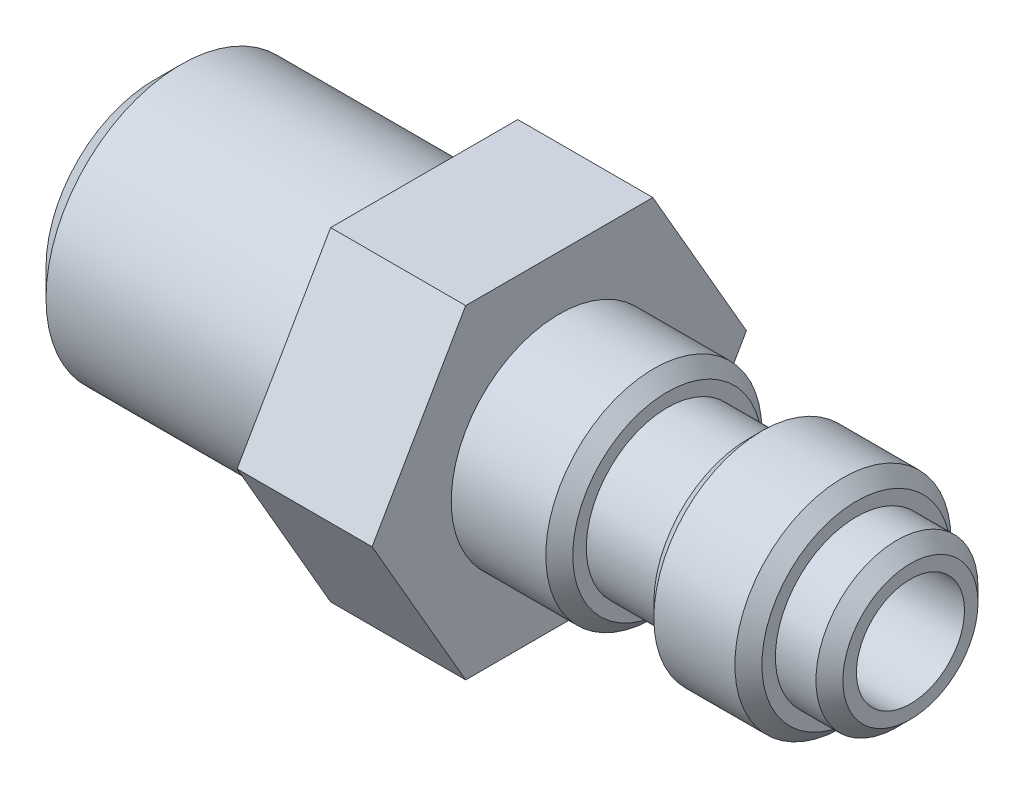
ISO-10303-21;
HEADER;
FILE_DESCRIPTION(('STEP AP214'),'2;1');
FILE_NAME('part.step','',(''),(''),'','','');
FILE_SCHEMA(('AUTOMOTIVE_DESIGN { 1 0 10303 214 1 1 1 1 }'));
ENDSEC;
DATA;
#1=APPLICATION_CONTEXT('core data for automotive mechanical design processes');
#2=APPLICATION_PROTOCOL_DEFINITION('international standard','automotive_design',2000,#1);
#3=PRODUCT_CONTEXT('',#1,'mechanical');
#4=PRODUCT('Part','Part','',(#3));
#5=PRODUCT_RELATED_PRODUCT_CATEGORY('part','',(#4));
#6=PRODUCT_DEFINITION_FORMATION('','',#4);
#7=PRODUCT_DEFINITION_CONTEXT('part definition',#1,'design');
#8=PRODUCT_DEFINITION('design','',#6,#7);
#9=PRODUCT_DEFINITION_SHAPE('','',#8);
#10=(LENGTH_UNIT() NAMED_UNIT(*) SI_UNIT(.MILLI.,.METRE.));
#11=(NAMED_UNIT(*) PLANE_ANGLE_UNIT() SI_UNIT($,.RADIAN.));
#12=(NAMED_UNIT(*) SI_UNIT($,.STERADIAN.) SOLID_ANGLE_UNIT());
#13=UNCERTAINTY_MEASURE_WITH_UNIT(LENGTH_MEASURE(1.E-05),#10,'distance_accuracy_value','');
#14=(GEOMETRIC_REPRESENTATION_CONTEXT(3) GLOBAL_UNCERTAINTY_ASSIGNED_CONTEXT((#13)) GLOBAL_UNIT_ASSIGNED_CONTEXT((#10,
#11,#12)) REPRESENTATION_CONTEXT('',''));
#15=CARTESIAN_POINT('',(0.,0.,0.));
#16=DIRECTION('',(0.,0.,1.));
#17=DIRECTION('',(1.,0.,0.));
#18=AXIS2_PLACEMENT_3D('',#15,#16,#17);
#19=CARTESIAN_POINT('',(0.,0.,0.));
#20=DIRECTION('',(1.,0.,0.));
#21=DIRECTION('',(0.,0.,-1.));
#22=AXIS2_PLACEMENT_3D('',#19,#20,#21);
#23=PLANE('',#22);
#24=CARTESIAN_POINT('',(0.,0.,0.));
#25=DIRECTION('',(1.,0.,0.));
#26=DIRECTION('',(0.,0.,-1.));
#27=AXIS2_PLACEMENT_3D('',#24,#25,#26);
#28=CIRCLE('',#27,2.49999999999999);
#29=CARTESIAN_POINT('',(0.,0.,-2.49999999999999));
#30=VERTEX_POINT('',#29);
#31=EDGE_CURVE('E163',#30,#30,#28,.T.);
#32=ORIENTED_EDGE('',*,*,#31,.T.);
#33=EDGE_LOOP('',(#32));
#34=FACE_BOUND('',#33,.T.);
#35=CARTESIAN_POINT('',(0.,0.,0.));
#36=DIRECTION('',(1.,0.,0.));
#37=DIRECTION('',(0.,0.,-1.));
#38=AXIS2_PLACEMENT_3D('',#35,#36,#37);
#39=CIRCLE('',#38,2.);
#40=CARTESIAN_POINT('',(0.,0.,-2.));
#41=VERTEX_POINT('',#40);
#42=EDGE_CURVE('E128',#41,#41,#39,.T.);
#43=ORIENTED_EDGE('',*,*,#42,.F.);
#44=EDGE_LOOP('',(#43));
#45=FACE_BOUND('',#44,.T.);
#46=ADVANCED_FACE('F38',(#34,#45),#23,.T.);
#47=CARTESIAN_POINT('',(8.87978142076503,0.,0.));
#48=DIRECTION('',(1.,0.,0.));
#49=DIRECTION('',(0.,0.,-1.));
#50=AXIS2_PLACEMENT_3D('',#47,#48,#49);
#51=CYLINDRICAL_SURFACE('',#50,3.);
#52=CARTESIAN_POINT('',(-0.500000000000006,0.,0.));
#53=DIRECTION('',(1.,0.,0.));
#54=DIRECTION('',(0.,0.,-1.));
#55=AXIS2_PLACEMENT_3D('',#52,#53,#54);
#56=CIRCLE('',#55,3.);
#57=CARTESIAN_POINT('',(-0.500000000000006,0.,-3.));
#58=VERTEX_POINT('',#57);
#59=EDGE_CURVE('E166',#58,#58,#56,.F.);
#60=ORIENTED_EDGE('',*,*,#59,.T.);
#61=EDGE_LOOP('',(#60));
#62=FACE_BOUND('',#61,.T.);
#63=CARTESIAN_POINT('',(-2.,0.,0.));
#64=DIRECTION('',(1.,0.,0.));
#65=DIRECTION('',(0.,0.,-1.));
#66=AXIS2_PLACEMENT_3D('',#63,#64,#65);
#67=CIRCLE('',#66,3.);
#68=CARTESIAN_POINT('',(-2.,0.,-3.));
#69=VERTEX_POINT('',#68);
#70=EDGE_CURVE('E153',#69,#69,#67,.T.);
#71=ORIENTED_EDGE('',*,*,#70,.T.);
#72=EDGE_LOOP('',(#71));
#73=FACE_BOUND('',#72,.T.);
#74=ADVANCED_FACE('F202',(#62,#73),#51,.T.);
#75=CARTESIAN_POINT('',(-2.,0.,-3.));
#76=DIRECTION('',(1.,0.,0.));
#77=DIRECTION('',(0.,0.,-1.));
#78=AXIS2_PLACEMENT_3D('',#75,#76,#77);
#79=PLANE('',#78);
#80=CARTESIAN_POINT('',(-2.,0.,0.));
#81=DIRECTION('',(1.,0.,0.));
#82=DIRECTION('',(0.,0.,-1.));
#83=AXIS2_PLACEMENT_3D('',#80,#81,#82);
#84=CIRCLE('',#83,3.50000000000001);
#85=CARTESIAN_POINT('',(-2.,0.,-3.50000000000001));
#86=VERTEX_POINT('',#85);
#87=EDGE_CURVE('E169',#86,#86,#84,.T.);
#88=ORIENTED_EDGE('',*,*,#87,.T.);
#89=EDGE_LOOP('',(#88));
#90=FACE_BOUND('',#89,.T.);
#91=ORIENTED_EDGE('',*,*,#70,.F.);
#92=EDGE_LOOP('',(#91));
#93=FACE_BOUND('',#92,.T.);
#94=ADVANCED_FACE('F208',(#90,#93),#79,.T.);
#95=CARTESIAN_POINT('',(8.87978142076503,0.,0.));
#96=DIRECTION('',(1.,0.,0.));
#97=DIRECTION('',(0.,0.,-1.));
#98=AXIS2_PLACEMENT_3D('',#95,#96,#97);
#99=CYLINDRICAL_SURFACE('',#98,4.);
#100=CARTESIAN_POINT('',(-2.49999999999999,0.,0.));
#101=DIRECTION('',(1.,0.,0.));
#102=DIRECTION('',(0.,0.,-1.));
#103=AXIS2_PLACEMENT_3D('',#100,#101,#102);
#104=CIRCLE('',#103,4.);
#105=CARTESIAN_POINT('',(-2.49999999999999,0.,-4.));
#106=VERTEX_POINT('',#105);
#107=EDGE_CURVE('E175',#106,#106,#104,.F.);
#108=ORIENTED_EDGE('',*,*,#107,.T.);
#109=EDGE_LOOP('',(#108));
#110=FACE_BOUND('',#109,.T.);
#111=CARTESIAN_POINT('',(-5.50000000000001,0.,0.));
#112=DIRECTION('',(-1.,0.,0.));
#113=DIRECTION('',(0.,0.,1.));
#114=AXIS2_PLACEMENT_3D('',#111,#112,#113);
#115=CIRCLE('',#114,4.);
#116=CARTESIAN_POINT('',(-5.50000000000001,0.,4.));
#117=VERTEX_POINT('',#116);
#118=EDGE_CURVE('E172',#117,#117,#115,.F.);
#119=ORIENTED_EDGE('',*,*,#118,.T.);
#120=EDGE_LOOP('',(#119));
#121=FACE_BOUND('',#120,.T.);
#122=ADVANCED_FACE('F235',(#110,#121),#99,.T.);
#123=CARTESIAN_POINT('',(-6.,0.,-4.));
#124=DIRECTION('',(-1.,0.,0.));
#125=DIRECTION('',(0.,0.,1.));
#126=AXIS2_PLACEMENT_3D('',#123,#124,#125);
#127=PLANE('',#126);
#128=CARTESIAN_POINT('',(-6.,0.,0.));
#129=DIRECTION('',(-1.,0.,0.));
#130=DIRECTION('',(0.,0.,1.));
#131=AXIS2_PLACEMENT_3D('',#128,#129,#130);
#132=CIRCLE('',#131,3.5);
#133=CARTESIAN_POINT('',(-6.,0.,3.5));
#134=VERTEX_POINT('',#133);
#135=EDGE_CURVE('E178',#134,#134,#132,.T.);
#136=ORIENTED_EDGE('',*,*,#135,.T.);
#137=EDGE_LOOP('',(#136));
#138=FACE_BOUND('',#137,.T.);
#139=CARTESIAN_POINT('',(-6.,0.,0.));
#140=DIRECTION('',(1.,0.,0.));
#141=DIRECTION('',(0.,0.,-1.));
#142=AXIS2_PLACEMENT_3D('',#139,#140,#141);
#143=CIRCLE('',#142,3.);
#144=CARTESIAN_POINT('',(-6.,0.,-3.));
#145=VERTEX_POINT('',#144);
#146=EDGE_CURVE('E150',#145,#145,#143,.T.);
#147=ORIENTED_EDGE('',*,*,#146,.T.);
#148=EDGE_LOOP('',(#147));
#149=FACE_BOUND('',#148,.T.);
#150=ADVANCED_FACE('F237',(#138,#149),#127,.T.);
#151=CARTESIAN_POINT('',(8.87978142076503,0.,0.));
#152=DIRECTION('',(1.,0.,0.));
#153=DIRECTION('',(0.,0.,-1.));
#154=AXIS2_PLACEMENT_3D('',#151,#152,#153);
#155=CYLINDRICAL_SURFACE('',#154,3.);
#156=CARTESIAN_POINT('',(-9.,0.,0.));
#157=DIRECTION('',(1.,0.,0.));
#158=DIRECTION('',(0.,0.,-1.));
#159=AXIS2_PLACEMENT_3D('',#156,#157,#158);
#160=CIRCLE('',#159,3.);
#161=CARTESIAN_POINT('',(-9.,0.,-3.));
#162=VERTEX_POINT('',#161);
#163=EDGE_CURVE('E147',#162,#162,#160,.T.);
#164=ORIENTED_EDGE('',*,*,#163,.T.);
#165=EDGE_LOOP('',(#164));
#166=FACE_BOUND('',#165,.T.);
#167=ORIENTED_EDGE('',*,*,#146,.F.);
#168=EDGE_LOOP('',(#167));
#169=FACE_BOUND('',#168,.T.);
#170=ADVANCED_FACE('F244',(#166,#169),#155,.T.);
#171=CARTESIAN_POINT('',(-9.,0.,-3.));
#172=DIRECTION('',(1.,0.,0.));
#173=DIRECTION('',(0.,0.,-1.));
#174=AXIS2_PLACEMENT_3D('',#171,#172,#173);
#175=PLANE('',#174);
#176=CARTESIAN_POINT('',(-9.,0.,0.));
#177=DIRECTION('',(1.,0.,0.));
#178=DIRECTION('',(0.,0.,-1.));
#179=AXIS2_PLACEMENT_3D('',#176,#177,#178);
#180=CIRCLE('',#179,3.5);
#181=CARTESIAN_POINT('',(-9.,0.,-3.5));
#182=VERTEX_POINT('',#181);
#183=EDGE_CURVE('E181',#182,#182,#180,.T.);
#184=ORIENTED_EDGE('',*,*,#183,.T.);
#185=EDGE_LOOP('',(#184));
#186=FACE_BOUND('',#185,.T.);
#187=ORIENTED_EDGE('',*,*,#163,.F.);
#188=EDGE_LOOP('',(#187));
#189=FACE_BOUND('',#188,.T.);
#190=ADVANCED_FACE('F251',(#186,#189),#175,.T.);
#191=CARTESIAN_POINT('',(8.87978142076503,0.,0.));
#192=DIRECTION('',(1.,0.,0.));
#193=DIRECTION('',(0.,0.,-1.));
#194=AXIS2_PLACEMENT_3D('',#191,#192,#193);
#195=CYLINDRICAL_SURFACE('',#194,4.);
#196=CARTESIAN_POINT('',(-9.5,0.,0.));
#197=DIRECTION('',(1.,0.,0.));
#198=DIRECTION('',(0.,0.,-1.));
#199=AXIS2_PLACEMENT_3D('',#196,#197,#198);
#200=CIRCLE('',#199,4.);
#201=CARTESIAN_POINT('',(-9.5,0.,-4.));
#202=VERTEX_POINT('',#201);
#203=EDGE_CURVE('E184',#202,#202,#200,.F.);
#204=ORIENTED_EDGE('',*,*,#203,.T.);
#205=EDGE_LOOP('',(#204));
#206=FACE_BOUND('',#205,.T.);
#207=CARTESIAN_POINT('',(-13.,0.,0.));
#208=DIRECTION('',(1.,0.,0.));
#209=DIRECTION('',(0.,0.,-1.));
#210=AXIS2_PLACEMENT_3D('',#207,#208,#209);
#211=CIRCLE('',#210,4.);
#212=CARTESIAN_POINT('',(-13.,0.,-4.));
#213=VERTEX_POINT('',#212);
#214=EDGE_CURVE('E144',#213,#213,#211,.T.);
#215=ORIENTED_EDGE('',*,*,#214,.T.);
#216=EDGE_LOOP('',(#215));
#217=FACE_BOUND('',#216,.T.);
#218=ADVANCED_FACE('F255',(#206,#217),#195,.T.);
#219=CARTESIAN_POINT('',(-18.,-6.,3.46410161513775));
#220=DIRECTION('',(0.,0.5,-0.866025403784439));
#221=DIRECTION('',(0.,0.866025403784439,0.5));
#222=AXIS2_PLACEMENT_3D('',#219,#220,#221);
#223=PLANE('',#222);
#224=DIRECTION('',(0.,0.866025403784439,0.5));
#225=VECTOR('',#224,1.);
#226=CARTESIAN_POINT('',(-13.,-6.,3.46410161513775));
#227=LINE('',#226,#225);
#228=CARTESIAN_POINT('',(-13.,-6.,3.46410161513775));
#229=VERTEX_POINT('',#228);
#230=CARTESIAN_POINT('',(-13.,0.,6.92820323027551));
#231=VERTEX_POINT('',#230);
#232=EDGE_CURVE('E124',#229,#231,#227,.T.);
#233=ORIENTED_EDGE('',*,*,#232,.T.);
#234=DIRECTION('',(1.,0.,0.));
#235=VECTOR('',#234,1.);
#236=CARTESIAN_POINT('',(-18.,0.,6.92820323027551));
#237=LINE('',#236,#235);
#238=CARTESIAN_POINT('',(-18.,0.,6.92820323027551));
#239=VERTEX_POINT('',#238);
#240=EDGE_CURVE('E142',#239,#231,#237,.T.);
#241=ORIENTED_EDGE('',*,*,#240,.F.);
#242=DIRECTION('',(0.,0.866025403784439,0.5));
#243=VECTOR('',#242,1.);
#244=CARTESIAN_POINT('',(-18.,-6.,3.46410161513775));
#245=LINE('',#244,#243);
#246=CARTESIAN_POINT('',(-18.,-6.,3.46410161513775));
#247=VERTEX_POINT('',#246);
#248=EDGE_CURVE('E135',#247,#239,#245,.T.);
#249=ORIENTED_EDGE('',*,*,#248,.F.);
#250=DIRECTION('',(1.,0.,0.));
#251=VECTOR('',#250,1.);
#252=CARTESIAN_POINT('',(-18.,-6.,3.46410161513775));
#253=LINE('',#252,#251);
#254=EDGE_CURVE('E120',#247,#229,#253,.T.);
#255=ORIENTED_EDGE('',*,*,#254,.T.);
#256=EDGE_LOOP('',(#233,#241,#249,#255));
#257=FACE_BOUND('',#256,.T.);
#258=ADVANCED_FACE('F259',(#257),#223,.F.);
#259=CARTESIAN_POINT('',(-18.,0.,6.92820323027551));
#260=DIRECTION('',(0.,-0.5,-0.866025403784439));
#261=DIRECTION('',(0.,0.866025403784439,-0.5));
#262=AXIS2_PLACEMENT_3D('',#259,#260,#261);
#263=PLANE('',#262);
#264=DIRECTION('',(0.,0.866025403784438,-0.5));
#265=VECTOR('',#264,1.);
#266=CARTESIAN_POINT('',(-13.,0.,6.92820323027551));
#267=LINE('',#266,#265);
#268=CARTESIAN_POINT('',(-13.,6.,3.46410161513775));
#269=VERTEX_POINT('',#268);
#270=EDGE_CURVE('E127',#231,#269,#267,.T.);
#271=ORIENTED_EDGE('',*,*,#270,.T.);
#272=DIRECTION('',(1.,0.,0.));
#273=VECTOR('',#272,1.);
#274=CARTESIAN_POINT('',(-18.,6.,3.46410161513775));
#275=LINE('',#274,#273);
#276=CARTESIAN_POINT('',(-18.,6.,3.46410161513775));
#277=VERTEX_POINT('',#276);
#278=EDGE_CURVE('E139',#277,#269,#275,.T.);
#279=ORIENTED_EDGE('',*,*,#278,.F.);
#280=DIRECTION('',(0.,0.866025403784438,-0.5));
#281=VECTOR('',#280,1.);
#282=CARTESIAN_POINT('',(-18.,0.,6.92820323027551));
#283=LINE('',#282,#281);
#284=EDGE_CURVE('E93',#239,#277,#283,.T.);
#285=ORIENTED_EDGE('',*,*,#284,.F.);
#286=ORIENTED_EDGE('',*,*,#240,.T.);
#287=EDGE_LOOP('',(#271,#279,#285,#286));
#288=FACE_BOUND('',#287,.T.);
#289=ADVANCED_FACE('F263',(#288),#263,.F.);
#290=CARTESIAN_POINT('',(-18.,6.,3.46410161513775));
#291=DIRECTION('',(0.,-1.,0.));
#292=DIRECTION('',(0.,0.,-1.));
#293=AXIS2_PLACEMENT_3D('',#290,#291,#292);
#294=PLANE('',#293);
#295=DIRECTION('',(0.,0.,-1.));
#296=VECTOR('',#295,1.);
#297=CARTESIAN_POINT('',(-13.,6.,3.46410161513775));
#298=LINE('',#297,#296);
#299=CARTESIAN_POINT('',(-13.,6.,-3.46410161513776));
#300=VERTEX_POINT('',#299);
#301=EDGE_CURVE('E130',#269,#300,#298,.T.);
#302=ORIENTED_EDGE('',*,*,#301,.T.);
#303=DIRECTION('',(1.,0.,0.));
#304=VECTOR('',#303,1.);
#305=CARTESIAN_POINT('',(-18.,6.,-3.46410161513776));
#306=LINE('',#305,#304);
#307=CARTESIAN_POINT('',(-18.,6.,-3.46410161513776));
#308=VERTEX_POINT('',#307);
#309=EDGE_CURVE('E115',#308,#300,#306,.T.);
#310=ORIENTED_EDGE('',*,*,#309,.F.);
#311=DIRECTION('',(0.,0.,-1.));
#312=VECTOR('',#311,1.);
#313=CARTESIAN_POINT('',(-18.,6.,3.46410161513775));
#314=LINE('',#313,#312);
#315=EDGE_CURVE('E106',#277,#308,#314,.T.);
#316=ORIENTED_EDGE('',*,*,#315,.F.);
#317=ORIENTED_EDGE('',*,*,#278,.T.);
#318=EDGE_LOOP('',(#302,#310,#316,#317));
#319=FACE_BOUND('',#318,.T.);
#320=ADVANCED_FACE('F267',(#319),#294,.F.);
#321=CARTESIAN_POINT('',(-18.,6.,-3.46410161513776));
#322=DIRECTION('',(0.,-0.5,0.866025403784439));
#323=DIRECTION('',(0.,-0.866025403784439,-0.5));
#324=AXIS2_PLACEMENT_3D('',#321,#322,#323);
#325=PLANE('',#324);
#326=DIRECTION('',(0.,-0.866025403784439,-0.5));
#327=VECTOR('',#326,1.);
#328=CARTESIAN_POINT('',(-13.,6.,-3.46410161513776));
#329=LINE('',#328,#327);
#330=CARTESIAN_POINT('',(-13.,0.,-6.92820323027551));
#331=VERTEX_POINT('',#330);
#332=EDGE_CURVE('E114',#300,#331,#329,.T.);
#333=ORIENTED_EDGE('',*,*,#332,.T.);
#334=DIRECTION('',(1.,0.,0.));
#335=VECTOR('',#334,1.);
#336=CARTESIAN_POINT('',(-18.,0.,-6.92820323027551));
#337=LINE('',#336,#335);
#338=CARTESIAN_POINT('',(-18.,0.,-6.92820323027551));
#339=VERTEX_POINT('',#338);
#340=EDGE_CURVE('E111',#339,#331,#337,.T.);
#341=ORIENTED_EDGE('',*,*,#340,.F.);
#342=DIRECTION('',(0.,-0.866025403784439,-0.5));
#343=VECTOR('',#342,1.);
#344=CARTESIAN_POINT('',(-18.,6.,-3.46410161513776));
#345=LINE('',#344,#343);
#346=EDGE_CURVE('E100',#308,#339,#345,.T.);
#347=ORIENTED_EDGE('',*,*,#346,.F.);
#348=ORIENTED_EDGE('',*,*,#309,.T.);
#349=EDGE_LOOP('',(#333,#341,#347,#348));
#350=FACE_BOUND('',#349,.T.);
#351=ADVANCED_FACE('F112',(#350),#325,.F.);
#352=CARTESIAN_POINT('',(-18.,0.,-6.92820323027551));
#353=DIRECTION('',(0.,0.5,0.866025403784438));
#354=DIRECTION('',(0.,-0.866025403784439,0.5));
#355=AXIS2_PLACEMENT_3D('',#352,#353,#354);
#356=PLANE('',#355);
#357=DIRECTION('',(0.,-0.866025403784439,0.5));
#358=VECTOR('',#357,1.);
#359=CARTESIAN_POINT('',(-13.,0.,-6.92820323027551));
#360=LINE('',#359,#358);
#361=CARTESIAN_POINT('',(-13.,-6.,-3.46410161513776));
#362=VERTEX_POINT('',#361);
#363=EDGE_CURVE('E78',#331,#362,#360,.T.);
#364=ORIENTED_EDGE('',*,*,#363,.T.);
#365=DIRECTION('',(1.,0.,0.));
#366=VECTOR('',#365,1.);
#367=CARTESIAN_POINT('',(-18.,-6.,-3.46410161513776));
#368=LINE('',#367,#366);
#369=CARTESIAN_POINT('',(-18.,-6.,-3.46410161513776));
#370=VERTEX_POINT('',#369);
#371=EDGE_CURVE('E116',#370,#362,#368,.T.);
#372=ORIENTED_EDGE('',*,*,#371,.F.);
#373=DIRECTION('',(0.,-0.866025403784439,0.5));
#374=VECTOR('',#373,1.);
#375=CARTESIAN_POINT('',(-18.,0.,-6.92820323027551));
#376=LINE('',#375,#374);
#377=EDGE_CURVE('E104',#339,#370,#376,.T.);
#378=ORIENTED_EDGE('',*,*,#377,.F.);
#379=ORIENTED_EDGE('',*,*,#340,.T.);
#380=EDGE_LOOP('',(#364,#372,#378,#379));
#381=FACE_BOUND('',#380,.T.);
#382=ADVANCED_FACE('F118',(#381),#356,.F.);
#383=CARTESIAN_POINT('',(-18.,-6.,-3.46410161513776));
#384=DIRECTION('',(0.,1.,0.));
#385=DIRECTION('',(0.,0.,1.));
#386=AXIS2_PLACEMENT_3D('',#383,#384,#385);
#387=PLANE('',#386);
#388=DIRECTION('',(0.,0.,1.));
#389=VECTOR('',#388,1.);
#390=CARTESIAN_POINT('',(-13.,-6.,-3.46410161513776));
#391=LINE('',#390,#389);
#392=EDGE_CURVE('E84',#362,#229,#391,.T.);
#393=ORIENTED_EDGE('',*,*,#392,.T.);
#394=ORIENTED_EDGE('',*,*,#254,.F.);
#395=DIRECTION('',(0.,0.,1.));
#396=VECTOR('',#395,1.);
#397=CARTESIAN_POINT('',(-18.,-6.,-3.46410161513776));
#398=LINE('',#397,#396);
#399=EDGE_CURVE('E55',#370,#247,#398,.T.);
#400=ORIENTED_EDGE('',*,*,#399,.F.);
#401=ORIENTED_EDGE('',*,*,#371,.T.);
#402=EDGE_LOOP('',(#393,#394,#400,#401));
#403=FACE_BOUND('',#402,.T.);
#404=ADVANCED_FACE('F275',(#403),#387,.F.);
#405=CARTESIAN_POINT('',(-18.,0.,0.));
#406=DIRECTION('',(-1.,0.,0.));
#407=DIRECTION('',(0.,0.,1.));
#408=AXIS2_PLACEMENT_3D('',#405,#406,#407);
#409=PLANE('',#408);
#410=CARTESIAN_POINT('',(-18.,0.,0.));
#411=DIRECTION('',(-1.,0.,0.));
#412=DIRECTION('',(0.,0.,1.));
#413=AXIS2_PLACEMENT_3D('',#410,#411,#412);
#414=CIRCLE('',#413,5.);
#415=CARTESIAN_POINT('',(-18.,0.,5.));
#416=VERTEX_POINT('',#415);
#417=EDGE_CURVE('E156',#416,#416,#414,.T.);
#418=ORIENTED_EDGE('',*,*,#417,.F.);
#419=EDGE_LOOP('',(#418));
#420=FACE_BOUND('',#419,.T.);
#421=ORIENTED_EDGE('',*,*,#248,.T.);
#422=ORIENTED_EDGE('',*,*,#284,.T.);
#423=ORIENTED_EDGE('',*,*,#315,.T.);
#424=ORIENTED_EDGE('',*,*,#346,.T.);
#425=ORIENTED_EDGE('',*,*,#377,.T.);
#426=ORIENTED_EDGE('',*,*,#399,.T.);
#427=EDGE_LOOP('',(#421,#422,#423,#424,#425,#426));
#428=FACE_BOUND('',#427,.T.);
#429=ADVANCED_FACE('F102',(#420,#428),#409,.T.);
#430=CARTESIAN_POINT('',(-13.,0.,0.));
#431=DIRECTION('',(-1.,0.,0.));
#432=DIRECTION('',(0.,0.,1.));
#433=AXIS2_PLACEMENT_3D('',#430,#431,#432);
#434=PLANE('',#433);
#435=ORIENTED_EDGE('',*,*,#214,.F.);
#436=EDGE_LOOP('',(#435));
#437=FACE_BOUND('',#436,.T.);
#438=ORIENTED_EDGE('',*,*,#232,.F.);
#439=ORIENTED_EDGE('',*,*,#392,.F.);
#440=ORIENTED_EDGE('',*,*,#363,.F.);
#441=ORIENTED_EDGE('',*,*,#332,.F.);
#442=ORIENTED_EDGE('',*,*,#301,.F.);
#443=ORIENTED_EDGE('',*,*,#270,.F.);
#444=EDGE_LOOP('',(#438,#439,#440,#441,#442,#443));
#445=FACE_BOUND('',#444,.T.);
#446=ADVANCED_FACE('F278',(#437,#445),#434,.F.);
#447=CARTESIAN_POINT('',(-28.,0.,0.));
#448=DIRECTION('',(1.,0.,0.));
#449=DIRECTION('',(0.,0.,-1.));
#450=AXIS2_PLACEMENT_3D('',#447,#448,#449);
#451=CYLINDRICAL_SURFACE('',#450,5.);
#452=CARTESIAN_POINT('',(-27.,0.,0.));
#453=DIRECTION('',(-1.,0.,0.));
#454=DIRECTION('',(0.,0.,1.));
#455=AXIS2_PLACEMENT_3D('',#452,#453,#454);
#456=CIRCLE('',#455,5.);
#457=CARTESIAN_POINT('',(-27.,0.,5.));
#458=VERTEX_POINT('',#457);
#459=EDGE_CURVE('E11',#458,#458,#456,.F.);
#460=ORIENTED_EDGE('',*,*,#459,.T.);
#461=EDGE_LOOP('',(#460));
#462=FACE_BOUND('',#461,.T.);
#463=ORIENTED_EDGE('',*,*,#417,.T.);
#464=EDGE_LOOP('',(#463));
#465=FACE_BOUND('',#464,.T.);
#466=ADVANCED_FACE('F281',(#462,#465),#451,.T.);
#467=CARTESIAN_POINT('',(-28.,0.,0.));
#468=DIRECTION('',(-1.,0.,0.));
#469=DIRECTION('',(0.,0.,1.));
#470=AXIS2_PLACEMENT_3D('',#467,#468,#469);
#471=PLANE('',#470);
#472=CARTESIAN_POINT('',(-28.,0.,0.));
#473=DIRECTION('',(-1.,0.,0.));
#474=DIRECTION('',(0.,0.,1.));
#475=AXIS2_PLACEMENT_3D('',#472,#473,#474);
#476=CIRCLE('',#475,4.);
#477=CARTESIAN_POINT('',(-28.,0.,4.));
#478=VERTEX_POINT('',#477);
#479=EDGE_CURVE('E47',#478,#478,#476,.T.);
#480=ORIENTED_EDGE('',*,*,#479,.T.);
#481=EDGE_LOOP('',(#480));
#482=FACE_BOUND('',#481,.T.);
#483=CARTESIAN_POINT('',(-28.,0.,0.));
#484=DIRECTION('',(-1.,0.,0.));
#485=DIRECTION('',(0.,0.,1.));
#486=AXIS2_PLACEMENT_3D('',#483,#484,#485);
#487=CIRCLE('',#486,2.49999999999998);
#488=CARTESIAN_POINT('',(-28.,0.,2.49999999999998));
#489=VERTEX_POINT('',#488);
#490=EDGE_CURVE('E157',#489,#489,#487,.F.);
#491=ORIENTED_EDGE('',*,*,#490,.T.);
#492=EDGE_LOOP('',(#491));
#493=FACE_BOUND('',#492,.T.);
#494=ADVANCED_FACE('F189',(#482,#493),#471,.T.);
#495=CARTESIAN_POINT('',(-28.,0.,0.));
#496=DIRECTION('',(1.,0.,0.));
#497=DIRECTION('',(0.,0.,-1.));
#498=AXIS2_PLACEMENT_3D('',#495,#496,#497);
#499=CYLINDRICAL_SURFACE('',#498,2.);
#500=CARTESIAN_POINT('',(-27.5,0.,0.));
#501=DIRECTION('',(-1.,0.,0.));
#502=DIRECTION('',(0.,0.,1.));
#503=AXIS2_PLACEMENT_3D('',#500,#501,#502);
#504=CIRCLE('',#503,2.);
#505=CARTESIAN_POINT('',(-27.5,0.,2.));
#506=VERTEX_POINT('',#505);
#507=EDGE_CURVE('E160',#506,#506,#504,.T.);
#508=ORIENTED_EDGE('',*,*,#507,.T.);
#509=EDGE_LOOP('',(#508));
#510=FACE_BOUND('',#509,.T.);
#511=ORIENTED_EDGE('',*,*,#42,.T.);
#512=EDGE_LOOP('',(#511));
#513=FACE_BOUND('',#512,.T.);
#514=ADVANCED_FACE('F218',(#510,#513),#499,.F.);
#515=CARTESIAN_POINT('',(-28.,0.,0.));
#516=DIRECTION('',(-1.,0.,0.));
#517=DIRECTION('',(0.,0.,1.));
#518=AXIS2_PLACEMENT_3D('',#515,#516,#517);
#519=CONICAL_SURFACE('',#518,2.49999999999998,0.78539816339745);
#520=ORIENTED_EDGE('',*,*,#507,.F.);
#521=EDGE_LOOP('',(#520));
#522=FACE_BOUND('',#521,.T.);
#523=ORIENTED_EDGE('',*,*,#490,.F.);
#524=EDGE_LOOP('',(#523));
#525=FACE_BOUND('',#524,.T.);
#526=ADVANCED_FACE('F214',(#522,#525),#519,.F.);
#527=CARTESIAN_POINT('',(0.,0.,0.));
#528=DIRECTION('',(-1.,0.,0.));
#529=DIRECTION('',(0.,0.,1.));
#530=AXIS2_PLACEMENT_3D('',#527,#528,#529);
#531=CONICAL_SURFACE('',#530,2.49999999999999,0.785398163397448);
#532=ORIENTED_EDGE('',*,*,#59,.F.);
#533=EDGE_LOOP('',(#532));
#534=FACE_BOUND('',#533,.T.);
#535=ORIENTED_EDGE('',*,*,#31,.F.);
#536=EDGE_LOOP('',(#535));
#537=FACE_BOUND('',#536,.T.);
#538=ADVANCED_FACE('F217',(#534,#537),#531,.T.);
#539=CARTESIAN_POINT('',(-2.,0.,0.));
#540=DIRECTION('',(-1.,0.,0.));
#541=DIRECTION('',(0.,0.,1.));
#542=AXIS2_PLACEMENT_3D('',#539,#540,#541);
#543=CONICAL_SURFACE('',#542,3.50000000000001,0.785398163397445);
#544=ORIENTED_EDGE('',*,*,#107,.F.);
#545=EDGE_LOOP('',(#544));
#546=FACE_BOUND('',#545,.T.);
#547=ORIENTED_EDGE('',*,*,#87,.F.);
#548=EDGE_LOOP('',(#547));
#549=FACE_BOUND('',#548,.T.);
#550=ADVANCED_FACE('F222',(#546,#549),#543,.T.);
#551=CARTESIAN_POINT('',(-5.50000000000001,0.,0.));
#552=DIRECTION('',(1.,0.,0.));
#553=DIRECTION('',(0.,0.,-1.));
#554=AXIS2_PLACEMENT_3D('',#551,#552,#553);
#555=CONICAL_SURFACE('',#554,4.,0.785398163397452);
#556=ORIENTED_EDGE('',*,*,#135,.F.);
#557=EDGE_LOOP('',(#556));
#558=FACE_BOUND('',#557,.T.);
#559=ORIENTED_EDGE('',*,*,#118,.F.);
#560=EDGE_LOOP('',(#559));
#561=FACE_BOUND('',#560,.T.);
#562=ADVANCED_FACE('F198',(#558,#561),#555,.T.);
#563=CARTESIAN_POINT('',(-9.,0.,0.));
#564=DIRECTION('',(-1.,0.,0.));
#565=DIRECTION('',(0.,0.,1.));
#566=AXIS2_PLACEMENT_3D('',#563,#564,#565);
#567=CONICAL_SURFACE('',#566,3.5,0.785398163397447);
#568=ORIENTED_EDGE('',*,*,#203,.F.);
#569=EDGE_LOOP('',(#568));
#570=FACE_BOUND('',#569,.T.);
#571=ORIENTED_EDGE('',*,*,#183,.F.);
#572=EDGE_LOOP('',(#571));
#573=FACE_BOUND('',#572,.T.);
#574=ADVANCED_FACE('F193',(#570,#573),#567,.T.);
#575=CARTESIAN_POINT('',(-28.,0.,0.));
#576=DIRECTION('',(1.,0.,0.));
#577=DIRECTION('',(0.,0.,-1.));
#578=AXIS2_PLACEMENT_3D('',#575,#576,#577);
#579=CONICAL_SURFACE('',#578,4.,0.785398163397448);
#580=ORIENTED_EDGE('',*,*,#459,.F.);
#581=EDGE_LOOP('',(#580));
#582=FACE_BOUND('',#581,.T.);
#583=ORIENTED_EDGE('',*,*,#479,.F.);
#584=EDGE_LOOP('',(#583));
#585=FACE_BOUND('',#584,.T.);
#586=ADVANCED_FACE('F40',(#582,#585),#579,.T.);
#587=CLOSED_SHELL('',(#46,#74,#94,#122,#150,#170,#190,#218,#258,#289,#320,#351,#382,#404,#429,
#446,#466,#494,#514,#526,#538,#550,#562,#574,#586));
#588=MANIFOLD_SOLID_BREP('B2',#587);
#589=ADVANCED_BREP_SHAPE_REPRESENTATION('',(#18,#588),#14);
#590=SHAPE_DEFINITION_REPRESENTATION(#9,#589);
ENDSEC;
END-ISO-10303-21;
